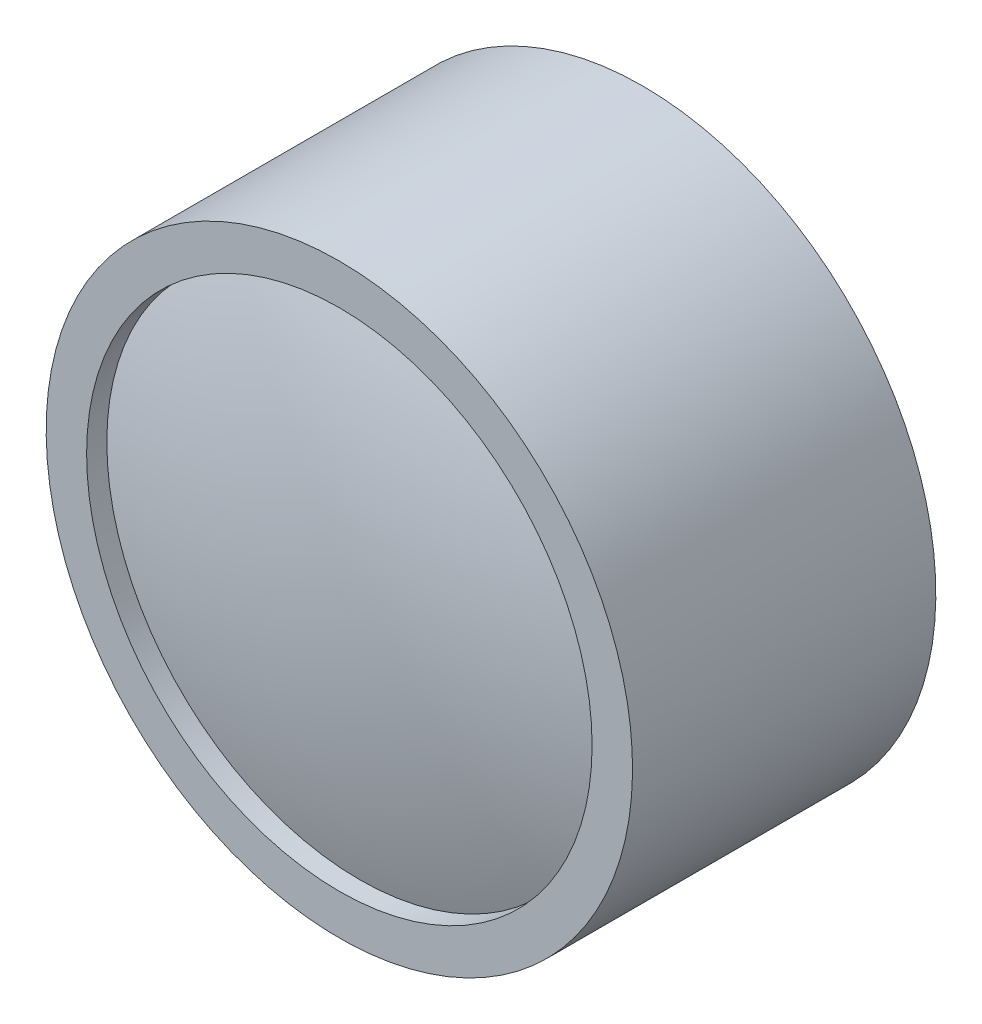
ISO-10303-21;
HEADER;
FILE_DESCRIPTION(('STEP AP214'),'2;1');
FILE_NAME('part.step','',(''),(''),'','','');
FILE_SCHEMA(('AUTOMOTIVE_DESIGN { 1 0 10303 214 1 1 1 1 }'));
ENDSEC;
DATA;
#1=APPLICATION_CONTEXT('core data for automotive mechanical design processes');
#2=APPLICATION_PROTOCOL_DEFINITION('international standard','automotive_design',2000,#1);
#3=PRODUCT_CONTEXT('',#1,'mechanical');
#4=PRODUCT('Part','Part','',(#3));
#5=PRODUCT_RELATED_PRODUCT_CATEGORY('part','',(#4));
#6=PRODUCT_DEFINITION_FORMATION('','',#4);
#7=PRODUCT_DEFINITION_CONTEXT('part definition',#1,'design');
#8=PRODUCT_DEFINITION('design','',#6,#7);
#9=PRODUCT_DEFINITION_SHAPE('','',#8);
#10=(LENGTH_UNIT() NAMED_UNIT(*) SI_UNIT(.MILLI.,.METRE.));
#11=(NAMED_UNIT(*) PLANE_ANGLE_UNIT() SI_UNIT($,.RADIAN.));
#12=(NAMED_UNIT(*) SI_UNIT($,.STERADIAN.) SOLID_ANGLE_UNIT());
#13=UNCERTAINTY_MEASURE_WITH_UNIT(LENGTH_MEASURE(1.E-05),#10,'distance_accuracy_value','');
#14=(GEOMETRIC_REPRESENTATION_CONTEXT(3) GLOBAL_UNCERTAINTY_ASSIGNED_CONTEXT((#13)) GLOBAL_UNIT_ASSIGNED_CONTEXT((#10,
#11,#12)) REPRESENTATION_CONTEXT('',''));
#15=CARTESIAN_POINT('',(0.,0.,0.));
#16=DIRECTION('',(0.,0.,1.));
#17=DIRECTION('',(1.,0.,0.));
#18=AXIS2_PLACEMENT_3D('',#15,#16,#17);
#19=CARTESIAN_POINT('',(0.,0.,0.));
#20=DIRECTION('',(0.,0.,-1.));
#21=DIRECTION('',(0.,1.,0.));
#22=AXIS2_PLACEMENT_3D('',#19,#20,#21);
#23=PLANE('',#22);
#24=CARTESIAN_POINT('',(0.,0.,0.));
#25=DIRECTION('',(0.,0.,-1.));
#26=DIRECTION('',(0.,1.,0.));
#27=AXIS2_PLACEMENT_3D('',#24,#25,#26);
#28=CIRCLE('',#27,14.5);
#29=CARTESIAN_POINT('',(0.,14.5,0.));
#30=VERTEX_POINT('',#29);
#31=EDGE_CURVE('E10',#30,#30,#28,.T.);
#32=ORIENTED_EDGE('',*,*,#31,.T.);
#33=EDGE_LOOP('',(#32));
#34=FACE_BOUND('',#33,.T.);
#35=ADVANCED_FACE('F37',(#34),#23,.T.);
#36=CARTESIAN_POINT('',(0.,0.,0.));
#37=DIRECTION('',(0.,0.,-1.));
#38=DIRECTION('',(0.,1.,0.));
#39=AXIS2_PLACEMENT_3D('',#36,#37,#38);
#40=CYLINDRICAL_SURFACE('',#39,14.5);
#41=CARTESIAN_POINT('',(0.,0.,15.));
#42=DIRECTION('',(0.,0.,-1.));
#43=DIRECTION('',(0.,1.,0.));
#44=AXIS2_PLACEMENT_3D('',#41,#42,#43);
#45=CIRCLE('',#44,14.5);
#46=CARTESIAN_POINT('',(0.,14.5,15.));
#47=VERTEX_POINT('',#46);
#48=EDGE_CURVE('E43',#47,#47,#45,.T.);
#49=ORIENTED_EDGE('',*,*,#48,.T.);
#50=EDGE_LOOP('',(#49));
#51=FACE_BOUND('',#50,.T.);
#52=ORIENTED_EDGE('',*,*,#31,.F.);
#53=EDGE_LOOP('',(#52));
#54=FACE_BOUND('',#53,.T.);
#55=ADVANCED_FACE('F69',(#51,#54),#40,.T.);
#56=CARTESIAN_POINT('',(0.,14.5,15.));
#57=DIRECTION('',(0.,0.,1.));
#58=DIRECTION('',(0.,-1.,0.));
#59=AXIS2_PLACEMENT_3D('',#56,#57,#58);
#60=PLANE('',#59);
#61=CARTESIAN_POINT('',(0.,0.,15.));
#62=DIRECTION('',(0.,0.,-1.));
#63=DIRECTION('',(0.,1.,0.));
#64=AXIS2_PLACEMENT_3D('',#61,#62,#63);
#65=CIRCLE('',#64,12.5);
#66=CARTESIAN_POINT('',(0.,12.5,15.));
#67=VERTEX_POINT('',#66);
#68=EDGE_CURVE('E47',#67,#67,#65,.T.);
#69=ORIENTED_EDGE('',*,*,#68,.T.);
#70=EDGE_LOOP('',(#69));
#71=FACE_BOUND('',#70,.T.);
#72=ORIENTED_EDGE('',*,*,#48,.F.);
#73=EDGE_LOOP('',(#72));
#74=FACE_BOUND('',#73,.T.);
#75=ADVANCED_FACE('F66',(#71,#74),#60,.T.);
#76=CARTESIAN_POINT('',(0.,0.,0.));
#77=DIRECTION('',(0.,0.,-1.));
#78=DIRECTION('',(0.,1.,0.));
#79=AXIS2_PLACEMENT_3D('',#76,#77,#78);
#80=CYLINDRICAL_SURFACE('',#79,12.5);
#81=CARTESIAN_POINT('',(0.,0.,14.));
#82=DIRECTION('',(0.,0.,-1.));
#83=DIRECTION('',(0.,1.,0.));
#84=AXIS2_PLACEMENT_3D('',#81,#82,#83);
#85=CIRCLE('',#84,12.5);
#86=CARTESIAN_POINT('',(0.,12.5,14.));
#87=VERTEX_POINT('',#86);
#88=EDGE_CURVE('E51',#87,#87,#85,.T.);
#89=ORIENTED_EDGE('',*,*,#88,.T.);
#90=EDGE_LOOP('',(#89));
#91=FACE_BOUND('',#90,.T.);
#92=ORIENTED_EDGE('',*,*,#68,.F.);
#93=EDGE_LOOP('',(#92));
#94=FACE_BOUND('',#93,.T.);
#95=ADVANCED_FACE('F57',(#91,#94),#80,.F.);
#96=CARTESIAN_POINT('',(0.,0.,-24.0625));
#97=DIRECTION('',(0.,0.,-1.));
#98=DIRECTION('',(0.,1.,0.));
#99=AXIS2_PLACEMENT_3D('',#96,#97,#98);
#100=SPHERICAL_SURFACE('',#99,40.0625);
#101=ORIENTED_EDGE('',*,*,#88,.F.);
#102=EDGE_LOOP('',(#101));
#103=FACE_BOUND('',#102,.T.);
#104=ADVANCED_FACE('F60',(#103),#100,.T.);
#105=CLOSED_SHELL('',(#35,#55,#75,#95,#104));
#106=MANIFOLD_SOLID_BREP('B2',#105);
#107=ADVANCED_BREP_SHAPE_REPRESENTATION('',(#18,#106),#14);
#108=SHAPE_DEFINITION_REPRESENTATION(#9,#107);
ENDSEC;
END-ISO-10303-21;
